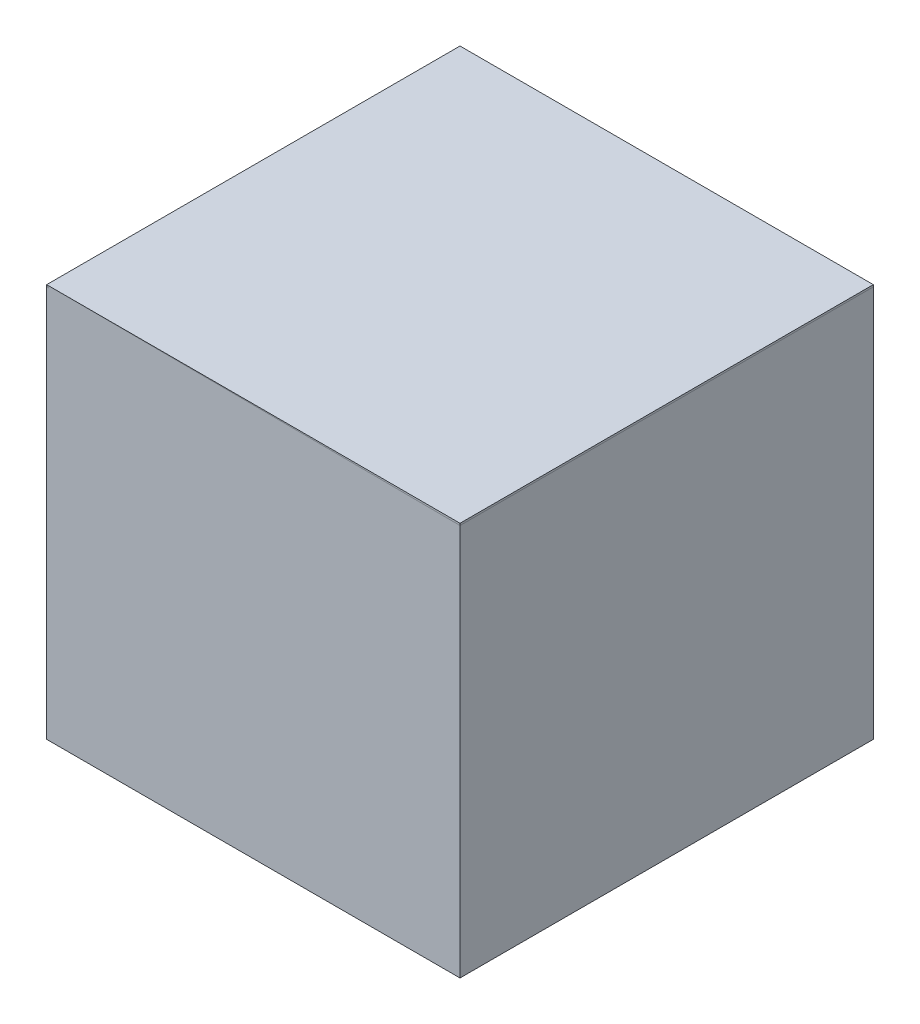
ISO-10303-21;
HEADER;
FILE_DESCRIPTION(('STEP AP214'),'2;1');
FILE_NAME('part.step','',(''),(''),'','','');
FILE_SCHEMA(('AUTOMOTIVE_DESIGN { 1 0 10303 214 1 1 1 1 }'));
ENDSEC;
DATA;
#1=APPLICATION_CONTEXT('core data for automotive mechanical design processes');
#2=APPLICATION_PROTOCOL_DEFINITION('international standard','automotive_design',2000,#1);
#3=PRODUCT_CONTEXT('',#1,'mechanical');
#4=PRODUCT('Part','Part','',(#3));
#5=PRODUCT_RELATED_PRODUCT_CATEGORY('part','',(#4));
#6=PRODUCT_DEFINITION_FORMATION('','',#4);
#7=PRODUCT_DEFINITION_CONTEXT('part definition',#1,'design');
#8=PRODUCT_DEFINITION('design','',#6,#7);
#9=PRODUCT_DEFINITION_SHAPE('','',#8);
#10=(LENGTH_UNIT() NAMED_UNIT(*) SI_UNIT(.MILLI.,.METRE.));
#11=(NAMED_UNIT(*) PLANE_ANGLE_UNIT() SI_UNIT($,.RADIAN.));
#12=(NAMED_UNIT(*) SI_UNIT($,.STERADIAN.) SOLID_ANGLE_UNIT());
#13=UNCERTAINTY_MEASURE_WITH_UNIT(LENGTH_MEASURE(1.E-05),#10,'distance_accuracy_value','');
#14=(GEOMETRIC_REPRESENTATION_CONTEXT(3) GLOBAL_UNCERTAINTY_ASSIGNED_CONTEXT((#13)) GLOBAL_UNIT_ASSIGNED_CONTEXT((#10,
#11,#12)) REPRESENTATION_CONTEXT('',''));
#15=CARTESIAN_POINT('',(0.,0.,0.));
#16=DIRECTION('',(0.,0.,1.));
#17=DIRECTION('',(1.,0.,0.));
#18=AXIS2_PLACEMENT_3D('',#15,#16,#17);
#19=CARTESIAN_POINT('',(69.493716421245,1030.00000000001,-530.452855008335));
#20=DIRECTION('',(1.,0.,0.));
#21=DIRECTION('',(0.,0.,-1.));
#22=AXIS2_PLACEMENT_3D('',#19,#20,#21);
#23=PLANE('',#22);
#24=DIRECTION('',(0.,0.,1.));
#25=VECTOR('',#24,1.);
#26=CARTESIAN_POINT('',(69.493716421245,1025.00000000001,-530.452855008335));
#27=LINE('',#26,#25);
#28=CARTESIAN_POINT('',(69.493716421245,1025.00000000001,-530.452855008335));
#29=VERTEX_POINT('',#28);
#30=CARTESIAN_POINT('',(69.493716421245,1025.00000000001,529.583144991665));
#31=VERTEX_POINT('',#30);
#32=EDGE_CURVE('E140',#29,#31,#27,.T.);
#33=ORIENTED_EDGE('',*,*,#32,.T.);
#34=DIRECTION('',(0.,-1.,0.));
#35=VECTOR('',#34,1.);
#36=CARTESIAN_POINT('',(69.493716421245,1030.00000000001,529.583144991665));
#37=LINE('',#36,#35);
#38=CARTESIAN_POINT('',(69.493716421245,1030.00000000001,529.583144991665));
#39=VERTEX_POINT('',#38);
#40=EDGE_CURVE('E13',#39,#31,#37,.T.);
#41=ORIENTED_EDGE('',*,*,#40,.F.);
#42=DIRECTION('',(0.,0.,1.));
#43=VECTOR('',#42,1.);
#44=CARTESIAN_POINT('',(69.493716421245,1030.00000000001,-530.452855008335));
#45=LINE('',#44,#43);
#46=CARTESIAN_POINT('',(69.493716421245,1030.00000000001,-530.452855008335));
#47=VERTEX_POINT('',#46);
#48=EDGE_CURVE('E128',#47,#39,#45,.T.);
#49=ORIENTED_EDGE('',*,*,#48,.F.);
#50=DIRECTION('',(0.,-1.,0.));
#51=VECTOR('',#50,1.);
#52=CARTESIAN_POINT('',(69.493716421245,1030.00000000001,-530.452855008335));
#53=LINE('',#52,#51);
#54=EDGE_CURVE('E136',#47,#29,#53,.T.);
#55=ORIENTED_EDGE('',*,*,#54,.T.);
#56=EDGE_LOOP('',(#33,#41,#49,#55));
#57=FACE_BOUND('',#56,.T.);
#58=ADVANCED_FACE('F77',(#57),#23,.F.);
#59=CARTESIAN_POINT('',(69.493716421245,1030.00000000001,529.583144991665));
#60=DIRECTION('',(0.,0.,-1.));
#61=DIRECTION('',(-1.,0.,0.));
#62=AXIS2_PLACEMENT_3D('',#59,#60,#61);
#63=PLANE('',#62);
#64=DIRECTION('',(1.,0.,0.));
#65=VECTOR('',#64,1.);
#66=CARTESIAN_POINT('',(69.493716421245,1025.00000000001,529.583144991665));
#67=LINE('',#66,#65);
#68=CARTESIAN_POINT('',(1129.52971642124,1025.00000000001,529.583144991665));
#69=VERTEX_POINT('',#68);
#70=EDGE_CURVE('E132',#31,#69,#67,.T.);
#71=ORIENTED_EDGE('',*,*,#70,.T.);
#72=DIRECTION('',(0.,-1.,0.));
#73=VECTOR('',#72,1.);
#74=CARTESIAN_POINT('',(1129.52971642124,1030.00000000001,529.583144991665));
#75=LINE('',#74,#73);
#76=CARTESIAN_POINT('',(1129.52971642124,1030.00000000001,529.583144991665));
#77=VERTEX_POINT('',#76);
#78=EDGE_CURVE('E85',#77,#69,#75,.T.);
#79=ORIENTED_EDGE('',*,*,#78,.F.);
#80=DIRECTION('',(1.,0.,0.));
#81=VECTOR('',#80,1.);
#82=CARTESIAN_POINT('',(69.493716421245,1030.00000000001,529.583144991665));
#83=LINE('',#82,#81);
#84=EDGE_CURVE('E123',#39,#77,#83,.T.);
#85=ORIENTED_EDGE('',*,*,#84,.F.);
#86=ORIENTED_EDGE('',*,*,#40,.T.);
#87=EDGE_LOOP('',(#71,#79,#85,#86));
#88=FACE_BOUND('',#87,.T.);
#89=ADVANCED_FACE('F131',(#88),#63,.F.);
#90=CARTESIAN_POINT('',(1129.52971642124,1030.00000000001,-530.452855008335));
#91=DIRECTION('',(-1.,0.,0.));
#92=DIRECTION('',(0.,0.,1.));
#93=AXIS2_PLACEMENT_3D('',#90,#91,#92);
#94=PLANE('',#93);
#95=DIRECTION('',(0.,0.,-1.));
#96=VECTOR('',#95,1.);
#97=CARTESIAN_POINT('',(1129.52971642124,1025.00000000001,-530.452855008335));
#98=LINE('',#97,#96);
#99=CARTESIAN_POINT('',(1129.52971642124,1025.00000000001,-530.452855008335));
#100=VERTEX_POINT('',#99);
#101=EDGE_CURVE('E110',#69,#100,#98,.T.);
#102=ORIENTED_EDGE('',*,*,#101,.T.);
#103=DIRECTION('',(0.,-1.,0.));
#104=VECTOR('',#103,1.);
#105=CARTESIAN_POINT('',(1129.52971642124,1030.00000000001,-530.452855008335));
#106=LINE('',#105,#104);
#107=CARTESIAN_POINT('',(1129.52971642124,1030.00000000001,-530.452855008335));
#108=VERTEX_POINT('',#107);
#109=EDGE_CURVE('E133',#108,#100,#106,.T.);
#110=ORIENTED_EDGE('',*,*,#109,.F.);
#111=DIRECTION('',(0.,0.,-1.));
#112=VECTOR('',#111,1.);
#113=CARTESIAN_POINT('',(1129.52971642124,1030.00000000001,-530.452855008335));
#114=LINE('',#113,#112);
#115=EDGE_CURVE('E126',#77,#108,#114,.T.);
#116=ORIENTED_EDGE('',*,*,#115,.F.);
#117=ORIENTED_EDGE('',*,*,#78,.T.);
#118=EDGE_LOOP('',(#102,#110,#116,#117));
#119=FACE_BOUND('',#118,.T.);
#120=ADVANCED_FACE('F134',(#119),#94,.F.);
#121=CARTESIAN_POINT('',(69.493716421245,1030.00000000001,-530.452855008335));
#122=DIRECTION('',(0.,0.,1.));
#123=DIRECTION('',(1.,0.,0.));
#124=AXIS2_PLACEMENT_3D('',#121,#122,#123);
#125=PLANE('',#124);
#126=DIRECTION('',(-1.,0.,0.));
#127=VECTOR('',#126,1.);
#128=CARTESIAN_POINT('',(69.493716421245,1025.00000000001,-530.452855008335));
#129=LINE('',#128,#127);
#130=EDGE_CURVE('E116',#100,#29,#129,.T.);
#131=ORIENTED_EDGE('',*,*,#130,.T.);
#132=ORIENTED_EDGE('',*,*,#54,.F.);
#133=DIRECTION('',(-1.,0.,0.));
#134=VECTOR('',#133,1.);
#135=CARTESIAN_POINT('',(69.493716421245,1030.00000000001,-530.452855008335));
#136=LINE('',#135,#134);
#137=EDGE_CURVE('E93',#108,#47,#136,.T.);
#138=ORIENTED_EDGE('',*,*,#137,.F.);
#139=ORIENTED_EDGE('',*,*,#109,.T.);
#140=EDGE_LOOP('',(#131,#132,#138,#139));
#141=FACE_BOUND('',#140,.T.);
#142=ADVANCED_FACE('F147',(#141),#125,.F.);
#143=CARTESIAN_POINT('',(0.,1030.00000000001,0.));
#144=DIRECTION('',(0.,1.,0.));
#145=DIRECTION('',(0.,0.,1.));
#146=AXIS2_PLACEMENT_3D('',#143,#144,#145);
#147=PLANE('',#146);
#148=ORIENTED_EDGE('',*,*,#48,.T.);
#149=ORIENTED_EDGE('',*,*,#84,.T.);
#150=ORIENTED_EDGE('',*,*,#115,.T.);
#151=ORIENTED_EDGE('',*,*,#137,.T.);
#152=EDGE_LOOP('',(#148,#149,#150,#151));
#153=FACE_BOUND('',#152,.T.);
#154=ADVANCED_FACE('F124',(#153),#147,.T.);
#155=CARTESIAN_POINT('',(0.,1025.00000000001,0.));
#156=DIRECTION('',(0.,1.,0.));
#157=DIRECTION('',(0.,0.,1.));
#158=AXIS2_PLACEMENT_3D('',#155,#156,#157);
#159=PLANE('',#158);
#160=ORIENTED_EDGE('',*,*,#32,.F.);
#161=ORIENTED_EDGE('',*,*,#130,.F.);
#162=ORIENTED_EDGE('',*,*,#101,.F.);
#163=ORIENTED_EDGE('',*,*,#70,.F.);
#164=EDGE_LOOP('',(#160,#161,#162,#163));
#165=FACE_BOUND('',#164,.T.);
#166=ADVANCED_FACE('F150',(#165),#159,.F.);
#167=CLOSED_SHELL('',(#58,#89,#120,#142,#154,#166));
#168=MANIFOLD_SOLID_BREP('B2',#167);
#169=CARTESIAN_POINT('',(69.493716421245,20.000000000012,-525.452855008339));
#170=DIRECTION('',(-1.,0.,0.));
#171=DIRECTION('',(0.,0.,1.));
#172=AXIS2_PLACEMENT_3D('',#169,#170,#171);
#173=PLANE('',#172);
#174=DIRECTION('',(0.,0.,1.));
#175=VECTOR('',#174,1.);
#176=CARTESIAN_POINT('',(69.493716421245,1030.00000000001,-525.452855008335));
#177=LINE('',#176,#175);
#178=CARTESIAN_POINT('',(69.493716421245,1030.00000000001,-530.452855008335));
#179=VERTEX_POINT('',#178);
#180=CARTESIAN_POINT('',(69.4937164212452,1030.00000000001,529.583144991665));
#181=VERTEX_POINT('',#180);
#182=EDGE_CURVE('E299',#179,#181,#177,.T.);
#183=ORIENTED_EDGE('',*,*,#182,.F.);
#184=DIRECTION('',(0.,1.,0.));
#185=VECTOR('',#184,1.);
#186=CARTESIAN_POINT('',(69.493716421245,20.000000000012,-530.452855008339));
#187=LINE('',#186,#185);
#188=CARTESIAN_POINT('',(69.493716421245,20.000000000012,-530.452855008339));
#189=VERTEX_POINT('',#188);
#190=EDGE_CURVE('E75',#189,#179,#187,.T.);
#191=ORIENTED_EDGE('',*,*,#190,.F.);
#192=DIRECTION('',(0.,0.,1.));
#193=VECTOR('',#192,1.);
#194=CARTESIAN_POINT('',(69.493716421245,20.000000000012,-525.452855008339));
#195=LINE('',#194,#193);
#196=CARTESIAN_POINT('',(69.4937164212452,20.0000000000085,529.583144991661));
#197=VERTEX_POINT('',#196);
#198=EDGE_CURVE('E303',#189,#197,#195,.T.);
#199=ORIENTED_EDGE('',*,*,#198,.T.);
#200=DIRECTION('',(0.,1.,0.));
#201=VECTOR('',#200,1.);
#202=CARTESIAN_POINT('',(69.4937164212452,20.0000000000085,529.583144991661));
#203=LINE('',#202,#201);
#204=EDGE_CURVE('E204',#197,#181,#203,.T.);
#205=ORIENTED_EDGE('',*,*,#204,.T.);
#206=EDGE_LOOP('',(#183,#191,#199,#205));
#207=FACE_BOUND('',#206,.T.);
#208=ADVANCED_FACE('F201',(#207),#173,.T.);
#209=CARTESIAN_POINT('',(1124.52971642125,20.000000000012,-530.452855008339));
#210=DIRECTION('',(0.,0.,-1.));
#211=DIRECTION('',(0.,1.,0.));
#212=AXIS2_PLACEMENT_3D('',#209,#210,#211);
#213=PLANE('',#212);
#214=DIRECTION('',(-1.,0.,0.));
#215=VECTOR('',#214,1.);
#216=CARTESIAN_POINT('',(1124.52971642125,1030.00000000001,-530.452855008335));
#217=LINE('',#216,#215);
#218=CARTESIAN_POINT('',(1129.52971642124,1030.00000000001,-530.452855008335));
#219=VERTEX_POINT('',#218);
#220=EDGE_CURVE('E307',#219,#179,#217,.T.);
#221=ORIENTED_EDGE('',*,*,#220,.F.);
#222=DIRECTION('',(0.,1.,0.));
#223=VECTOR('',#222,1.);
#224=CARTESIAN_POINT('',(1129.52971642124,20.000000000012,-530.452855008339));
#225=LINE('',#224,#223);
#226=CARTESIAN_POINT('',(1129.52971642124,20.000000000012,-530.452855008339));
#227=VERTEX_POINT('',#226);
#228=EDGE_CURVE('E209',#227,#219,#225,.T.);
#229=ORIENTED_EDGE('',*,*,#228,.F.);
#230=DIRECTION('',(-1.,0.,0.));
#231=VECTOR('',#230,1.);
#232=CARTESIAN_POINT('',(1124.52971642125,20.000000000012,-530.452855008339));
#233=LINE('',#232,#231);
#234=EDGE_CURVE('E313',#227,#189,#233,.T.);
#235=ORIENTED_EDGE('',*,*,#234,.T.);
#236=ORIENTED_EDGE('',*,*,#190,.T.);
#237=EDGE_LOOP('',(#221,#229,#235,#236));
#238=FACE_BOUND('',#237,.T.);
#239=ADVANCED_FACE('F339',(#238),#213,.T.);
#240=CARTESIAN_POINT('',(1129.52971642124,20.0000000000085,524.583144991661));
#241=DIRECTION('',(1.,0.,0.));
#242=DIRECTION('',(0.,0.,-1.));
#243=AXIS2_PLACEMENT_3D('',#240,#241,#242);
#244=PLANE('',#243);
#245=DIRECTION('',(0.,0.,-1.));
#246=VECTOR('',#245,1.);
#247=CARTESIAN_POINT('',(1129.52971642124,1030.00000000001,524.583144991665));
#248=LINE('',#247,#246);
#249=CARTESIAN_POINT('',(1129.52971642124,1030.00000000001,529.583144991665));
#250=VERTEX_POINT('',#249);
#251=EDGE_CURVE('E321',#250,#219,#248,.T.);
#252=ORIENTED_EDGE('',*,*,#251,.F.);
#253=DIRECTION('',(0.,1.,0.));
#254=VECTOR('',#253,1.);
#255=CARTESIAN_POINT('',(1129.52971642124,20.0000000000085,529.583144991661));
#256=LINE('',#255,#254);
#257=CARTESIAN_POINT('',(1129.52971642124,20.0000000000085,529.583144991661));
#258=VERTEX_POINT('',#257);
#259=EDGE_CURVE('E326',#258,#250,#256,.T.);
#260=ORIENTED_EDGE('',*,*,#259,.F.);
#261=DIRECTION('',(0.,0.,-1.));
#262=VECTOR('',#261,1.);
#263=CARTESIAN_POINT('',(1129.52971642124,20.0000000000085,524.583144991661));
#264=LINE('',#263,#262);
#265=EDGE_CURVE('E310',#258,#227,#264,.T.);
#266=ORIENTED_EDGE('',*,*,#265,.T.);
#267=ORIENTED_EDGE('',*,*,#228,.T.);
#268=EDGE_LOOP('',(#252,#260,#266,#267));
#269=FACE_BOUND('',#268,.T.);
#270=ADVANCED_FACE('F343',(#269),#244,.T.);
#271=CARTESIAN_POINT('',(74.4937164212452,20.0000000000085,529.583144991661));
#272=DIRECTION('',(0.,0.,1.));
#273=DIRECTION('',(0.,-1.,0.));
#274=AXIS2_PLACEMENT_3D('',#271,#272,#273);
#275=PLANE('',#274);
#276=DIRECTION('',(1.,0.,0.));
#277=VECTOR('',#276,1.);
#278=CARTESIAN_POINT('',(74.4937164212452,1030.00000000001,529.583144991665));
#279=LINE('',#278,#277);
#280=EDGE_CURVE('E318',#181,#250,#279,.T.);
#281=ORIENTED_EDGE('',*,*,#280,.F.);
#282=ORIENTED_EDGE('',*,*,#204,.F.);
#283=DIRECTION('',(1.,0.,0.));
#284=VECTOR('',#283,1.);
#285=CARTESIAN_POINT('',(74.4937164212452,20.0000000000085,529.583144991661));
#286=LINE('',#285,#284);
#287=EDGE_CURVE('E306',#197,#258,#286,.T.);
#288=ORIENTED_EDGE('',*,*,#287,.T.);
#289=ORIENTED_EDGE('',*,*,#259,.T.);
#290=EDGE_LOOP('',(#281,#282,#288,#289));
#291=FACE_BOUND('',#290,.T.);
#292=ADVANCED_FACE('F334',(#291),#275,.T.);
#293=CARTESIAN_POINT('',(0.,20.0000000000102,0.));
#294=DIRECTION('',(0.,1.,0.));
#295=DIRECTION('',(0.,0.,1.));
#296=AXIS2_PLACEMENT_3D('',#293,#294,#295);
#297=PLANE('',#296);
#298=DIRECTION('',(-1.,0.,0.));
#299=VECTOR('',#298,1.);
#300=CARTESIAN_POINT('',(1124.52971642125,20.000000000012,-525.452855008339));
#301=LINE('',#300,#299);
#302=CARTESIAN_POINT('',(1124.52971642125,20.000000000012,-525.452855008339));
#303=VERTEX_POINT('',#302);
#304=CARTESIAN_POINT('',(74.493716421245,20.000000000012,-525.452855008339));
#305=VERTEX_POINT('',#304);
#306=EDGE_CURVE('E274',#303,#305,#301,.T.);
#307=ORIENTED_EDGE('',*,*,#306,.T.);
#308=DIRECTION('',(0.,0.,1.));
#309=VECTOR('',#308,1.);
#310=CARTESIAN_POINT('',(74.493716421245,20.000000000012,-525.452855008339));
#311=LINE('',#310,#309);
#312=CARTESIAN_POINT('',(74.4937164212452,20.0000000000085,524.583144991661));
#313=VERTEX_POINT('',#312);
#314=EDGE_CURVE('E268',#305,#313,#311,.T.);
#315=ORIENTED_EDGE('',*,*,#314,.T.);
#316=DIRECTION('',(1.,0.,0.));
#317=VECTOR('',#316,1.);
#318=CARTESIAN_POINT('',(74.4937164212452,20.0000000000085,524.583144991661));
#319=LINE('',#318,#317);
#320=CARTESIAN_POINT('',(1124.52971642125,20.0000000000085,524.583144991661));
#321=VERTEX_POINT('',#320);
#322=EDGE_CURVE('E277',#313,#321,#319,.T.);
#323=ORIENTED_EDGE('',*,*,#322,.T.);
#324=DIRECTION('',(0.,0.,-1.));
#325=VECTOR('',#324,1.);
#326=CARTESIAN_POINT('',(1124.52971642125,20.0000000000085,524.583144991661));
#327=LINE('',#326,#325);
#328=EDGE_CURVE('E217',#321,#303,#327,.T.);
#329=ORIENTED_EDGE('',*,*,#328,.T.);
#330=EDGE_LOOP('',(#307,#315,#323,#329));
#331=FACE_BOUND('',#330,.T.);
#332=ORIENTED_EDGE('',*,*,#198,.F.);
#333=ORIENTED_EDGE('',*,*,#234,.F.);
#334=ORIENTED_EDGE('',*,*,#265,.F.);
#335=ORIENTED_EDGE('',*,*,#287,.F.);
#336=EDGE_LOOP('',(#332,#333,#334,#335));
#337=FACE_BOUND('',#336,.T.);
#338=ADVANCED_FACE('F281',(#331,#337),#297,.F.);
#339=CARTESIAN_POINT('',(0.,1030.00000000001,3.48492345897146E-12));
#340=DIRECTION('',(0.,1.,0.));
#341=DIRECTION('',(0.,0.,1.));
#342=AXIS2_PLACEMENT_3D('',#339,#340,#341);
#343=PLANE('',#342);
#344=DIRECTION('',(0.,0.,1.));
#345=VECTOR('',#344,1.);
#346=CARTESIAN_POINT('',(74.493716421245,1030.00000000001,-525.452855008335));
#347=LINE('',#346,#345);
#348=CARTESIAN_POINT('',(74.493716421245,1030.00000000001,-525.452855008335));
#349=VERTEX_POINT('',#348);
#350=CARTESIAN_POINT('',(74.4937164212452,1030.00000000001,524.583144991665));
#351=VERTEX_POINT('',#350);
#352=EDGE_CURVE('E225',#349,#351,#347,.T.);
#353=ORIENTED_EDGE('',*,*,#352,.F.);
#354=DIRECTION('',(-1.,0.,0.));
#355=VECTOR('',#354,1.);
#356=CARTESIAN_POINT('',(1124.52971642125,1030.00000000001,-525.452855008335));
#357=LINE('',#356,#355);
#358=CARTESIAN_POINT('',(1124.52971642125,1030.00000000001,-525.452855008335));
#359=VERTEX_POINT('',#358);
#360=EDGE_CURVE('E284',#359,#349,#357,.T.);
#361=ORIENTED_EDGE('',*,*,#360,.F.);
#362=DIRECTION('',(0.,0.,-1.));
#363=VECTOR('',#362,1.);
#364=CARTESIAN_POINT('',(1124.52971642125,1030.00000000001,524.583144991665));
#365=LINE('',#364,#363);
#366=CARTESIAN_POINT('',(1124.52971642125,1030.00000000001,524.583144991665));
#367=VERTEX_POINT('',#366);
#368=EDGE_CURVE('E287',#367,#359,#365,.T.);
#369=ORIENTED_EDGE('',*,*,#368,.F.);
#370=DIRECTION('',(1.,0.,0.));
#371=VECTOR('',#370,1.);
#372=CARTESIAN_POINT('',(74.4937164212452,1030.00000000001,524.583144991665));
#373=LINE('',#372,#371);
#374=EDGE_CURVE('E293',#351,#367,#373,.T.);
#375=ORIENTED_EDGE('',*,*,#374,.F.);
#376=EDGE_LOOP('',(#353,#361,#369,#375));
#377=FACE_BOUND('',#376,.T.);
#378=ORIENTED_EDGE('',*,*,#182,.T.);
#379=ORIENTED_EDGE('',*,*,#280,.T.);
#380=ORIENTED_EDGE('',*,*,#251,.T.);
#381=ORIENTED_EDGE('',*,*,#220,.T.);
#382=EDGE_LOOP('',(#378,#379,#380,#381));
#383=FACE_BOUND('',#382,.T.);
#384=ADVANCED_FACE('F336',(#377,#383),#343,.T.);
#385=CARTESIAN_POINT('',(74.493716421245,20.000000000012,-525.452855008339));
#386=DIRECTION('',(-1.,0.,0.));
#387=DIRECTION('',(0.,0.,1.));
#388=AXIS2_PLACEMENT_3D('',#385,#386,#387);
#389=PLANE('',#388);
#390=ORIENTED_EDGE('',*,*,#352,.T.);
#391=DIRECTION('',(0.,1.,0.));
#392=VECTOR('',#391,1.);
#393=CARTESIAN_POINT('',(74.4937164212452,20.0000000000085,524.583144991661));
#394=LINE('',#393,#392);
#395=EDGE_CURVE('E264',#313,#351,#394,.T.);
#396=ORIENTED_EDGE('',*,*,#395,.F.);
#397=ORIENTED_EDGE('',*,*,#314,.F.);
#398=DIRECTION('',(0.,1.,0.));
#399=VECTOR('',#398,1.);
#400=CARTESIAN_POINT('',(74.493716421245,20.000000000012,-525.452855008339));
#401=LINE('',#400,#399);
#402=EDGE_CURVE('E297',#305,#349,#401,.T.);
#403=ORIENTED_EDGE('',*,*,#402,.T.);
#404=EDGE_LOOP('',(#390,#396,#397,#403));
#405=FACE_BOUND('',#404,.T.);
#406=ADVANCED_FACE('F266',(#405),#389,.F.);
#407=CARTESIAN_POINT('',(1124.52971642125,20.000000000012,-525.452855008339));
#408=DIRECTION('',(0.,0.,-1.));
#409=DIRECTION('',(0.,1.,0.));
#410=AXIS2_PLACEMENT_3D('',#407,#408,#409);
#411=PLANE('',#410);
#412=ORIENTED_EDGE('',*,*,#360,.T.);
#413=ORIENTED_EDGE('',*,*,#402,.F.);
#414=ORIENTED_EDGE('',*,*,#306,.F.);
#415=DIRECTION('',(0.,1.,0.));
#416=VECTOR('',#415,1.);
#417=CARTESIAN_POINT('',(1124.52971642125,20.000000000012,-525.452855008339));
#418=LINE('',#417,#416);
#419=EDGE_CURVE('E300',#303,#359,#418,.T.);
#420=ORIENTED_EDGE('',*,*,#419,.T.);
#421=EDGE_LOOP('',(#412,#413,#414,#420));
#422=FACE_BOUND('',#421,.T.);
#423=ADVANCED_FACE('F396',(#422),#411,.F.);
#424=CARTESIAN_POINT('',(1124.52971642125,20.0000000000085,524.583144991661));
#425=DIRECTION('',(1.,0.,0.));
#426=DIRECTION('',(0.,0.,-1.));
#427=AXIS2_PLACEMENT_3D('',#424,#425,#426);
#428=PLANE('',#427);
#429=ORIENTED_EDGE('',*,*,#368,.T.);
#430=ORIENTED_EDGE('',*,*,#419,.F.);
#431=ORIENTED_EDGE('',*,*,#328,.F.);
#432=DIRECTION('',(0.,1.,0.));
#433=VECTOR('',#432,1.);
#434=CARTESIAN_POINT('',(1124.52971642125,20.0000000000085,524.583144991661));
#435=LINE('',#434,#433);
#436=EDGE_CURVE('E273',#321,#367,#435,.T.);
#437=ORIENTED_EDGE('',*,*,#436,.T.);
#438=EDGE_LOOP('',(#429,#430,#431,#437));
#439=FACE_BOUND('',#438,.T.);
#440=ADVANCED_FACE('F405',(#439),#428,.F.);
#441=CARTESIAN_POINT('',(74.4937164212452,20.0000000000085,524.583144991661));
#442=DIRECTION('',(0.,0.,1.));
#443=DIRECTION('',(0.,-1.,0.));
#444=AXIS2_PLACEMENT_3D('',#441,#442,#443);
#445=PLANE('',#444);
#446=ORIENTED_EDGE('',*,*,#374,.T.);
#447=ORIENTED_EDGE('',*,*,#436,.F.);
#448=ORIENTED_EDGE('',*,*,#322,.F.);
#449=ORIENTED_EDGE('',*,*,#395,.T.);
#450=EDGE_LOOP('',(#446,#447,#448,#449));
#451=FACE_BOUND('',#450,.T.);
#452=ADVANCED_FACE('F278',(#451),#445,.F.);
#453=CLOSED_SHELL('',(#208,#239,#270,#292,#338,#384,#406,#423,#440,#452));
#454=MANIFOLD_SOLID_BREP('B7',#453);
#455=ADVANCED_BREP_SHAPE_REPRESENTATION('',(#18,#168,#454),#14);
#456=SHAPE_DEFINITION_REPRESENTATION(#9,#455);
ENDSEC;
END-ISO-10303-21;
